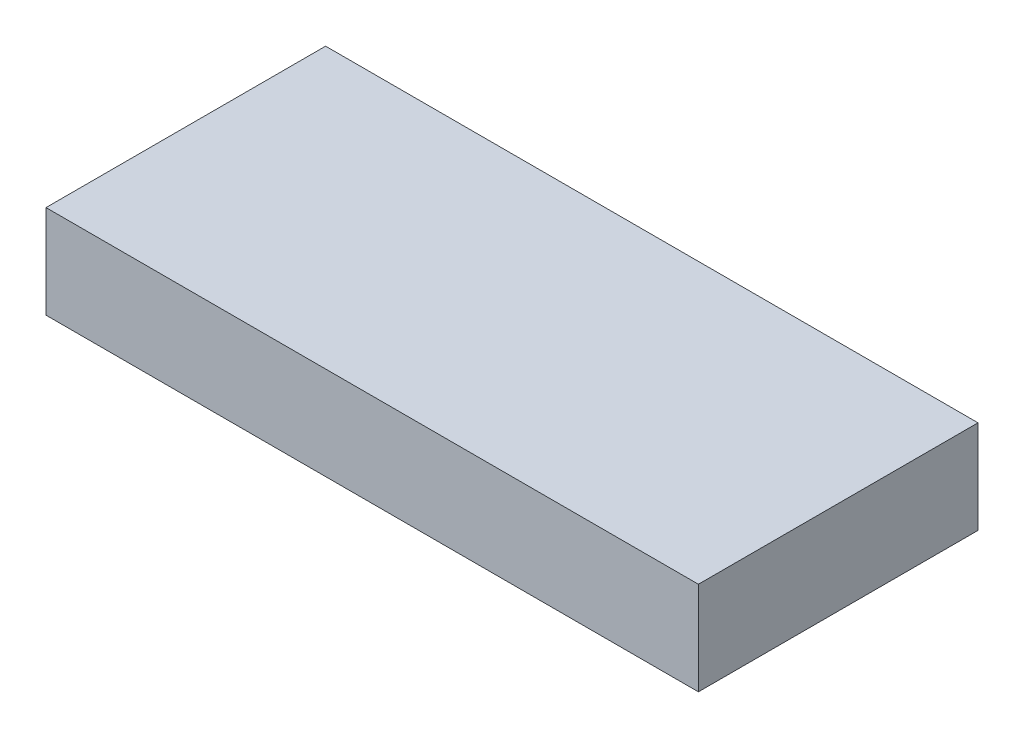
ISO-10303-21;
HEADER;
FILE_DESCRIPTION(('STEP AP214'),'2;1');
FILE_NAME('part.step','',(''),(''),'','','');
FILE_SCHEMA(('AUTOMOTIVE_DESIGN { 1 0 10303 214 1 1 1 1 }'));
ENDSEC;
DATA;
#1=APPLICATION_CONTEXT('core data for automotive mechanical design processes');
#2=APPLICATION_PROTOCOL_DEFINITION('international standard','automotive_design',2000,#1);
#3=PRODUCT_CONTEXT('',#1,'mechanical');
#4=PRODUCT('Part','Part','',(#3));
#5=PRODUCT_RELATED_PRODUCT_CATEGORY('part','',(#4));
#6=PRODUCT_DEFINITION_FORMATION('','',#4);
#7=PRODUCT_DEFINITION_CONTEXT('part definition',#1,'design');
#8=PRODUCT_DEFINITION('design','',#6,#7);
#9=PRODUCT_DEFINITION_SHAPE('','',#8);
#10=(LENGTH_UNIT() NAMED_UNIT(*) SI_UNIT(.MILLI.,.METRE.));
#11=(NAMED_UNIT(*) PLANE_ANGLE_UNIT() SI_UNIT($,.RADIAN.));
#12=(NAMED_UNIT(*) SI_UNIT($,.STERADIAN.) SOLID_ANGLE_UNIT());
#13=UNCERTAINTY_MEASURE_WITH_UNIT(LENGTH_MEASURE(1.E-05),#10,'distance_accuracy_value','');
#14=(GEOMETRIC_REPRESENTATION_CONTEXT(3) GLOBAL_UNCERTAINTY_ASSIGNED_CONTEXT((#13)) GLOBAL_UNIT_ASSIGNED_CONTEXT((#10,
#11,#12)) REPRESENTATION_CONTEXT('',''));
#15=CARTESIAN_POINT('',(0.,0.,0.));
#16=DIRECTION('',(0.,0.,1.));
#17=DIRECTION('',(1.,0.,0.));
#18=AXIS2_PLACEMENT_3D('',#15,#16,#17);
#19=CARTESIAN_POINT('',(-8.89,2.54,-3.81));
#20=DIRECTION('',(1.,0.,0.));
#21=DIRECTION('',(0.,0.,-1.));
#22=AXIS2_PLACEMENT_3D('',#19,#20,#21);
#23=PLANE('',#22);
#24=DIRECTION('',(0.,0.,1.));
#25=VECTOR('',#24,1.);
#26=CARTESIAN_POINT('',(-8.89,0.,-3.81));
#27=LINE('',#26,#25);
#28=CARTESIAN_POINT('',(-8.89,0.,-3.81));
#29=VERTEX_POINT('',#28);
#30=CARTESIAN_POINT('',(-8.89,0.,3.81));
#31=VERTEX_POINT('',#30);
#32=EDGE_CURVE('E94',#29,#31,#27,.T.);
#33=ORIENTED_EDGE('',*,*,#32,.T.);
#34=DIRECTION('',(0.,-1.,0.));
#35=VECTOR('',#34,1.);
#36=CARTESIAN_POINT('',(-8.89,2.54,3.81));
#37=LINE('',#36,#35);
#38=CARTESIAN_POINT('',(-8.89,2.54,3.81));
#39=VERTEX_POINT('',#38);
#40=EDGE_CURVE('E11',#39,#31,#37,.T.);
#41=ORIENTED_EDGE('',*,*,#40,.F.);
#42=DIRECTION('',(0.,0.,1.));
#43=VECTOR('',#42,1.);
#44=CARTESIAN_POINT('',(-8.89,2.54,-3.81));
#45=LINE('',#44,#43);
#46=CARTESIAN_POINT('',(-8.89,2.54,-3.81));
#47=VERTEX_POINT('',#46);
#48=EDGE_CURVE('E82',#47,#39,#45,.T.);
#49=ORIENTED_EDGE('',*,*,#48,.F.);
#50=DIRECTION('',(0.,-1.,0.));
#51=VECTOR('',#50,1.);
#52=CARTESIAN_POINT('',(-8.89,2.54,-3.81));
#53=LINE('',#52,#51);
#54=EDGE_CURVE('E90',#47,#29,#53,.T.);
#55=ORIENTED_EDGE('',*,*,#54,.T.);
#56=EDGE_LOOP('',(#33,#41,#49,#55));
#57=FACE_BOUND('',#56,.T.);
#58=ADVANCED_FACE('F31',(#57),#23,.F.);
#59=CARTESIAN_POINT('',(-8.89,2.54,3.81));
#60=DIRECTION('',(0.,0.,-1.));
#61=DIRECTION('',(-1.,0.,0.));
#62=AXIS2_PLACEMENT_3D('',#59,#60,#61);
#63=PLANE('',#62);
#64=DIRECTION('',(1.,0.,0.));
#65=VECTOR('',#64,1.);
#66=CARTESIAN_POINT('',(-8.89,0.,3.81));
#67=LINE('',#66,#65);
#68=CARTESIAN_POINT('',(8.89,0.,3.81));
#69=VERTEX_POINT('',#68);
#70=EDGE_CURVE('E86',#31,#69,#67,.T.);
#71=ORIENTED_EDGE('',*,*,#70,.T.);
#72=DIRECTION('',(0.,-1.,0.));
#73=VECTOR('',#72,1.);
#74=CARTESIAN_POINT('',(8.89,2.54,3.81));
#75=LINE('',#74,#73);
#76=CARTESIAN_POINT('',(8.89,2.54,3.81));
#77=VERTEX_POINT('',#76);
#78=EDGE_CURVE('E39',#77,#69,#75,.T.);
#79=ORIENTED_EDGE('',*,*,#78,.F.);
#80=DIRECTION('',(1.,0.,0.));
#81=VECTOR('',#80,1.);
#82=CARTESIAN_POINT('',(-8.89,2.54,3.81));
#83=LINE('',#82,#81);
#84=EDGE_CURVE('E77',#39,#77,#83,.T.);
#85=ORIENTED_EDGE('',*,*,#84,.F.);
#86=ORIENTED_EDGE('',*,*,#40,.T.);
#87=EDGE_LOOP('',(#71,#79,#85,#86));
#88=FACE_BOUND('',#87,.T.);
#89=ADVANCED_FACE('F85',(#88),#63,.F.);
#90=CARTESIAN_POINT('',(8.89,2.54,-3.81));
#91=DIRECTION('',(-1.,0.,0.));
#92=DIRECTION('',(0.,0.,1.));
#93=AXIS2_PLACEMENT_3D('',#90,#91,#92);
#94=PLANE('',#93);
#95=DIRECTION('',(0.,0.,-1.));
#96=VECTOR('',#95,1.);
#97=CARTESIAN_POINT('',(8.89,0.,-3.81));
#98=LINE('',#97,#96);
#99=CARTESIAN_POINT('',(8.89,0.,-3.81));
#100=VERTEX_POINT('',#99);
#101=EDGE_CURVE('E64',#69,#100,#98,.T.);
#102=ORIENTED_EDGE('',*,*,#101,.T.);
#103=DIRECTION('',(0.,-1.,0.));
#104=VECTOR('',#103,1.);
#105=CARTESIAN_POINT('',(8.89,2.54,-3.81));
#106=LINE('',#105,#104);
#107=CARTESIAN_POINT('',(8.89,2.54,-3.81));
#108=VERTEX_POINT('',#107);
#109=EDGE_CURVE('E87',#108,#100,#106,.T.);
#110=ORIENTED_EDGE('',*,*,#109,.F.);
#111=DIRECTION('',(0.,0.,-1.));
#112=VECTOR('',#111,1.);
#113=CARTESIAN_POINT('',(8.89,2.54,-3.81));
#114=LINE('',#113,#112);
#115=EDGE_CURVE('E80',#77,#108,#114,.T.);
#116=ORIENTED_EDGE('',*,*,#115,.F.);
#117=ORIENTED_EDGE('',*,*,#78,.T.);
#118=EDGE_LOOP('',(#102,#110,#116,#117));
#119=FACE_BOUND('',#118,.T.);
#120=ADVANCED_FACE('F88',(#119),#94,.F.);
#121=CARTESIAN_POINT('',(-8.89,2.54,-3.81));
#122=DIRECTION('',(0.,0.,1.));
#123=DIRECTION('',(1.,0.,0.));
#124=AXIS2_PLACEMENT_3D('',#121,#122,#123);
#125=PLANE('',#124);
#126=DIRECTION('',(-1.,0.,0.));
#127=VECTOR('',#126,1.);
#128=CARTESIAN_POINT('',(-8.89,0.,-3.81));
#129=LINE('',#128,#127);
#130=EDGE_CURVE('E70',#100,#29,#129,.T.);
#131=ORIENTED_EDGE('',*,*,#130,.T.);
#132=ORIENTED_EDGE('',*,*,#54,.F.);
#133=DIRECTION('',(-1.,0.,0.));
#134=VECTOR('',#133,1.);
#135=CARTESIAN_POINT('',(-8.89,2.54,-3.81));
#136=LINE('',#135,#134);
#137=EDGE_CURVE('E47',#108,#47,#136,.T.);
#138=ORIENTED_EDGE('',*,*,#137,.F.);
#139=ORIENTED_EDGE('',*,*,#109,.T.);
#140=EDGE_LOOP('',(#131,#132,#138,#139));
#141=FACE_BOUND('',#140,.T.);
#142=ADVANCED_FACE('F101',(#141),#125,.F.);
#143=CARTESIAN_POINT('',(-8.89,2.54,-3.81));
#144=DIRECTION('',(0.,1.,0.));
#145=DIRECTION('',(0.,0.,1.));
#146=AXIS2_PLACEMENT_3D('',#143,#144,#145);
#147=PLANE('',#146);
#148=ORIENTED_EDGE('',*,*,#48,.T.);
#149=ORIENTED_EDGE('',*,*,#84,.T.);
#150=ORIENTED_EDGE('',*,*,#115,.T.);
#151=ORIENTED_EDGE('',*,*,#137,.T.);
#152=EDGE_LOOP('',(#148,#149,#150,#151));
#153=FACE_BOUND('',#152,.T.);
#154=ADVANCED_FACE('F78',(#153),#147,.T.);
#155=CARTESIAN_POINT('',(-8.89,0.,-3.81));
#156=DIRECTION('',(0.,1.,0.));
#157=DIRECTION('',(0.,0.,1.));
#158=AXIS2_PLACEMENT_3D('',#155,#156,#157);
#159=PLANE('',#158);
#160=ORIENTED_EDGE('',*,*,#32,.F.);
#161=ORIENTED_EDGE('',*,*,#130,.F.);
#162=ORIENTED_EDGE('',*,*,#101,.F.);
#163=ORIENTED_EDGE('',*,*,#70,.F.);
#164=EDGE_LOOP('',(#160,#161,#162,#163));
#165=FACE_BOUND('',#164,.T.);
#166=ADVANCED_FACE('F104',(#165),#159,.F.);
#167=CLOSED_SHELL('',(#58,#89,#120,#142,#154,#166));
#168=MANIFOLD_SOLID_BREP('B2',#167);
#169=ADVANCED_BREP_SHAPE_REPRESENTATION('',(#18,#168),#14);
#170=SHAPE_DEFINITION_REPRESENTATION(#9,#169);
ENDSEC;
END-ISO-10303-21;
